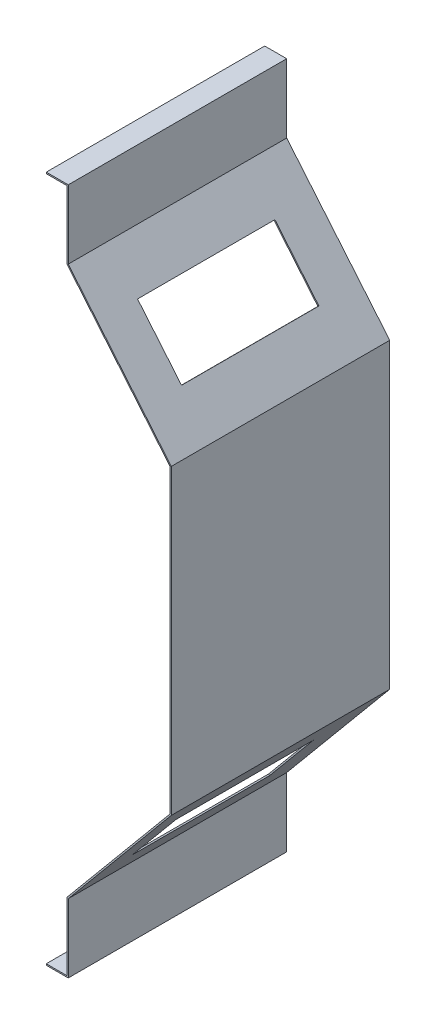
ISO-10303-21;
HEADER;
FILE_DESCRIPTION(('STEP AP214'),'2;1');
FILE_NAME('part.step','',(''),(''),'','','');
FILE_SCHEMA(('AUTOMOTIVE_DESIGN { 1 0 10303 214 1 1 1 1 }'));
ENDSEC;
DATA;
#1=APPLICATION_CONTEXT('core data for automotive mechanical design processes');
#2=APPLICATION_PROTOCOL_DEFINITION('international standard','automotive_design',2000,#1);
#3=PRODUCT_CONTEXT('',#1,'mechanical');
#4=PRODUCT('Part','Part','',(#3));
#5=PRODUCT_RELATED_PRODUCT_CATEGORY('part','',(#4));
#6=PRODUCT_DEFINITION_FORMATION('','',#4);
#7=PRODUCT_DEFINITION_CONTEXT('part definition',#1,'design');
#8=PRODUCT_DEFINITION('design','',#6,#7);
#9=PRODUCT_DEFINITION_SHAPE('','',#8);
#10=(LENGTH_UNIT() NAMED_UNIT(*) SI_UNIT(.MILLI.,.METRE.));
#11=(NAMED_UNIT(*) PLANE_ANGLE_UNIT() SI_UNIT($,.RADIAN.));
#12=(NAMED_UNIT(*) SI_UNIT($,.STERADIAN.) SOLID_ANGLE_UNIT());
#13=UNCERTAINTY_MEASURE_WITH_UNIT(LENGTH_MEASURE(1.E-05),#10,'distance_accuracy_value','');
#14=(GEOMETRIC_REPRESENTATION_CONTEXT(3) GLOBAL_UNCERTAINTY_ASSIGNED_CONTEXT((#13)) GLOBAL_UNIT_ASSIGNED_CONTEXT((#10,
#11,#12)) REPRESENTATION_CONTEXT('',''));
#15=CARTESIAN_POINT('',(0.,0.,0.));
#16=DIRECTION('',(0.,0.,1.));
#17=DIRECTION('',(1.,0.,0.));
#18=AXIS2_PLACEMENT_3D('',#15,#16,#17);
#19=CARTESIAN_POINT('',(-91.,250.,159.));
#20=DIRECTION('',(0.,-1.,0.));
#21=DIRECTION('',(0.,0.,-1.));
#22=AXIS2_PLACEMENT_3D('',#19,#20,#21);
#23=PLANE('',#22);
#24=DIRECTION('',(-1.,0.,0.));
#25=VECTOR('',#24,1.);
#26=CARTESIAN_POINT('',(-91.,250.,0.));
#27=LINE('',#26,#25);
#28=CARTESIAN_POINT('',(-75.,250.,0.));
#29=VERTEX_POINT('',#28);
#30=CARTESIAN_POINT('',(-91.,250.,0.));
#31=VERTEX_POINT('',#30);
#32=EDGE_CURVE('E263',#29,#31,#27,.T.);
#33=ORIENTED_EDGE('',*,*,#32,.T.);
#34=DIRECTION('',(0.,0.,-1.));
#35=VECTOR('',#34,1.);
#36=CARTESIAN_POINT('',(-91.,250.,159.));
#37=LINE('',#36,#35);
#38=CARTESIAN_POINT('',(-91.,250.,159.));
#39=VERTEX_POINT('',#38);
#40=EDGE_CURVE('E41',#39,#31,#37,.T.);
#41=ORIENTED_EDGE('',*,*,#40,.F.);
#42=DIRECTION('',(-1.,0.,0.));
#43=VECTOR('',#42,1.);
#44=CARTESIAN_POINT('',(-91.,250.,159.));
#45=LINE('',#44,#43);
#46=CARTESIAN_POINT('',(-75.,250.,159.));
#47=VERTEX_POINT('',#46);
#48=EDGE_CURVE('E267',#47,#39,#45,.T.);
#49=ORIENTED_EDGE('',*,*,#48,.F.);
#50=DIRECTION('',(0.,0.,-1.));
#51=VECTOR('',#50,1.);
#52=CARTESIAN_POINT('',(-75.,250.,159.));
#53=LINE('',#52,#51);
#54=EDGE_CURVE('E11',#47,#29,#53,.T.);
#55=ORIENTED_EDGE('',*,*,#54,.T.);
#56=EDGE_LOOP('',(#33,#41,#49,#55));
#57=FACE_BOUND('',#56,.T.);
#58=ADVANCED_FACE('F34',(#57),#23,.F.);
#59=CARTESIAN_POINT('',(-91.,250.,159.));
#60=DIRECTION('',(1.,0.,0.));
#61=DIRECTION('',(0.,0.,-1.));
#62=AXIS2_PLACEMENT_3D('',#59,#60,#61);
#63=PLANE('',#62);
#64=DIRECTION('',(0.,-1.,0.));
#65=VECTOR('',#64,1.);
#66=CARTESIAN_POINT('',(-91.,250.,0.));
#67=LINE('',#66,#65);
#68=CARTESIAN_POINT('',(-91.,249.,0.));
#69=VERTEX_POINT('',#68);
#70=EDGE_CURVE('E301',#31,#69,#67,.T.);
#71=ORIENTED_EDGE('',*,*,#70,.T.);
#72=DIRECTION('',(0.,0.,-1.));
#73=VECTOR('',#72,1.);
#74=CARTESIAN_POINT('',(-91.,249.,159.));
#75=LINE('',#74,#73);
#76=CARTESIAN_POINT('',(-91.,249.,159.));
#77=VERTEX_POINT('',#76);
#78=EDGE_CURVE('E369',#77,#69,#75,.T.);
#79=ORIENTED_EDGE('',*,*,#78,.F.);
#80=DIRECTION('',(0.,-1.,0.));
#81=VECTOR('',#80,1.);
#82=CARTESIAN_POINT('',(-91.,250.,159.));
#83=LINE('',#82,#81);
#84=EDGE_CURVE('E270',#39,#77,#83,.T.);
#85=ORIENTED_EDGE('',*,*,#84,.F.);
#86=ORIENTED_EDGE('',*,*,#40,.T.);
#87=EDGE_LOOP('',(#71,#79,#85,#86));
#88=FACE_BOUND('',#87,.T.);
#89=ADVANCED_FACE('F376',(#88),#63,.F.);
#90=CARTESIAN_POINT('',(-76.,249.,159.));
#91=DIRECTION('',(0.,1.,0.));
#92=DIRECTION('',(0.,0.,1.));
#93=AXIS2_PLACEMENT_3D('',#90,#91,#92);
#94=PLANE('',#93);
#95=DIRECTION('',(1.,0.,0.));
#96=VECTOR('',#95,1.);
#97=CARTESIAN_POINT('',(-76.,249.,0.));
#98=LINE('',#97,#96);
#99=CARTESIAN_POINT('',(-76.,249.,0.));
#100=VERTEX_POINT('',#99);
#101=EDGE_CURVE('E303',#69,#100,#98,.T.);
#102=ORIENTED_EDGE('',*,*,#101,.T.);
#103=DIRECTION('',(0.,0.,-1.));
#104=VECTOR('',#103,1.);
#105=CARTESIAN_POINT('',(-76.,249.,159.));
#106=LINE('',#105,#104);
#107=CARTESIAN_POINT('',(-76.,249.,159.));
#108=VERTEX_POINT('',#107);
#109=EDGE_CURVE('E366',#108,#100,#106,.T.);
#110=ORIENTED_EDGE('',*,*,#109,.F.);
#111=DIRECTION('',(1.,0.,0.));
#112=VECTOR('',#111,1.);
#113=CARTESIAN_POINT('',(-76.,249.,159.));
#114=LINE('',#113,#112);
#115=EDGE_CURVE('E272',#77,#108,#114,.T.);
#116=ORIENTED_EDGE('',*,*,#115,.F.);
#117=ORIENTED_EDGE('',*,*,#78,.T.);
#118=EDGE_LOOP('',(#102,#110,#116,#117));
#119=FACE_BOUND('',#118,.T.);
#120=ADVANCED_FACE('F388',(#119),#94,.F.);
#121=CARTESIAN_POINT('',(-76.,249.,159.));
#122=DIRECTION('',(1.,0.,0.));
#123=DIRECTION('',(0.,1.,0.));
#124=AXIS2_PLACEMENT_3D('',#121,#122,#123);
#125=PLANE('',#124);
#126=DIRECTION('',(0.,-1.,0.));
#127=VECTOR('',#126,1.);
#128=CARTESIAN_POINT('',(-76.,249.,0.));
#129=LINE('',#128,#127);
#130=CARTESIAN_POINT('',(-76.,199.637950064819,0.));
#131=VERTEX_POINT('',#130);
#132=EDGE_CURVE('E305',#100,#131,#129,.T.);
#133=ORIENTED_EDGE('',*,*,#132,.T.);
#134=DIRECTION('',(0.,0.,-1.));
#135=VECTOR('',#134,1.);
#136=CARTESIAN_POINT('',(-76.,199.637950064819,159.));
#137=LINE('',#136,#135);
#138=CARTESIAN_POINT('',(-76.,199.637950064819,159.));
#139=VERTEX_POINT('',#138);
#140=EDGE_CURVE('E363',#139,#131,#137,.T.);
#141=ORIENTED_EDGE('',*,*,#140,.F.);
#142=DIRECTION('',(0.,-1.,0.));
#143=VECTOR('',#142,1.);
#144=CARTESIAN_POINT('',(-76.,249.,159.));
#145=LINE('',#144,#143);
#146=EDGE_CURVE('E274',#108,#139,#145,.T.);
#147=ORIENTED_EDGE('',*,*,#146,.F.);
#148=ORIENTED_EDGE('',*,*,#109,.T.);
#149=EDGE_LOOP('',(#133,#141,#147,#148));
#150=FACE_BOUND('',#149,.T.);
#151=ADVANCED_FACE('F392',(#150),#125,.F.);
#152=CARTESIAN_POINT('',(-76.,199.637950064819,159.));
#153=DIRECTION('',(0.768221279597376,0.64018439966448,0.));
#154=DIRECTION('',(-0.64018439966448,0.768221279597376,0.));
#155=AXIS2_PLACEMENT_3D('',#152,#153,#154);
#156=PLANE('',#155);
#157=DIRECTION('',(0.,0.,-1.));
#158=VECTOR('',#157,1.);
#159=CARTESIAN_POINT('',(-22.3128239076133,135.213338753955,159.));
#160=LINE('',#159,#158);
#161=CARTESIAN_POINT('',(-22.3128239076133,135.213338753955,130.));
#162=VERTEX_POINT('',#161);
#163=CARTESIAN_POINT('',(-22.3128239076133,135.213338753955,30.));
#164=VERTEX_POINT('',#163);
#165=EDGE_CURVE('E225',#162,#164,#160,.T.);
#166=ORIENTED_EDGE('',*,*,#165,.T.);
#167=DIRECTION('',(-0.64018439966448,0.768221279597376,0.));
#168=VECTOR('',#167,1.);
#169=CARTESIAN_POINT('',(-76.,199.637950064819,30.));
#170=LINE('',#169,#168);
#171=CARTESIAN_POINT('',(-54.3220438908373,173.624402733823,30.));
#172=VERTEX_POINT('',#171);
#173=EDGE_CURVE('E228',#164,#172,#170,.T.);
#174=ORIENTED_EDGE('',*,*,#173,.T.);
#175=DIRECTION('',(0.,0.,1.));
#176=VECTOR('',#175,1.);
#177=CARTESIAN_POINT('',(-54.3220438908373,173.624402733823,159.));
#178=LINE('',#177,#176);
#179=CARTESIAN_POINT('',(-54.3220438908373,173.624402733823,130.));
#180=VERTEX_POINT('',#179);
#181=EDGE_CURVE('E220',#172,#180,#178,.T.);
#182=ORIENTED_EDGE('',*,*,#181,.T.);
#183=DIRECTION('',(0.64018439966448,-0.768221279597376,0.));
#184=VECTOR('',#183,1.);
#185=CARTESIAN_POINT('',(-76.,199.637950064819,130.));
#186=LINE('',#185,#184);
#187=EDGE_CURVE('E200',#180,#162,#186,.T.);
#188=ORIENTED_EDGE('',*,*,#187,.T.);
#189=EDGE_LOOP('',(#166,#174,#182,#188));
#190=FACE_BOUND('',#189,.T.);
#191=DIRECTION('',(0.64018439966448,-0.768221279597376,0.));
#192=VECTOR('',#191,1.);
#193=CARTESIAN_POINT('',(-76.,199.637950064819,0.));
#194=LINE('',#193,#192);
#195=CARTESIAN_POINT('',(-1.,109.637950064819,0.));
#196=VERTEX_POINT('',#195);
#197=EDGE_CURVE('E307',#131,#196,#194,.T.);
#198=ORIENTED_EDGE('',*,*,#197,.T.);
#199=DIRECTION('',(0.,0.,-1.));
#200=VECTOR('',#199,1.);
#201=CARTESIAN_POINT('',(-1.,109.637950064819,159.));
#202=LINE('',#201,#200);
#203=CARTESIAN_POINT('',(-1.,109.637950064819,159.));
#204=VERTEX_POINT('',#203);
#205=EDGE_CURVE('E360',#204,#196,#202,.T.);
#206=ORIENTED_EDGE('',*,*,#205,.F.);
#207=DIRECTION('',(0.64018439966448,-0.768221279597376,0.));
#208=VECTOR('',#207,1.);
#209=CARTESIAN_POINT('',(-76.,199.637950064819,159.));
#210=LINE('',#209,#208);
#211=EDGE_CURVE('E276',#139,#204,#210,.T.);
#212=ORIENTED_EDGE('',*,*,#211,.F.);
#213=ORIENTED_EDGE('',*,*,#140,.T.);
#214=EDGE_LOOP('',(#198,#206,#212,#213));
#215=FACE_BOUND('',#214,.T.);
#216=ADVANCED_FACE('F449',(#190,#215),#156,.F.);
#217=CARTESIAN_POINT('',(-1.,109.637950064819,159.));
#218=DIRECTION('',(1.,0.,0.));
#219=DIRECTION('',(0.,1.,0.));
#220=AXIS2_PLACEMENT_3D('',#217,#218,#219);
#221=PLANE('',#220);
#222=DIRECTION('',(0.,-1.,0.));
#223=VECTOR('',#222,1.);
#224=CARTESIAN_POINT('',(-1.,109.637950064819,0.));
#225=LINE('',#224,#223);
#226=CARTESIAN_POINT('',(-1.,-109.637950064819,0.));
#227=VERTEX_POINT('',#226);
#228=EDGE_CURVE('E309',#196,#227,#225,.T.);
#229=ORIENTED_EDGE('',*,*,#228,.T.);
#230=DIRECTION('',(0.,0.,-1.));
#231=VECTOR('',#230,1.);
#232=CARTESIAN_POINT('',(-1.,-109.637950064819,159.));
#233=LINE('',#232,#231);
#234=CARTESIAN_POINT('',(-1.,-109.637950064819,159.));
#235=VERTEX_POINT('',#234);
#236=EDGE_CURVE('E357',#235,#227,#233,.T.);
#237=ORIENTED_EDGE('',*,*,#236,.F.);
#238=DIRECTION('',(0.,-1.,0.));
#239=VECTOR('',#238,1.);
#240=CARTESIAN_POINT('',(-1.,109.637950064819,159.));
#241=LINE('',#240,#239);
#242=EDGE_CURVE('E278',#204,#235,#241,.T.);
#243=ORIENTED_EDGE('',*,*,#242,.F.);
#244=ORIENTED_EDGE('',*,*,#205,.T.);
#245=EDGE_LOOP('',(#229,#237,#243,#244));
#246=FACE_BOUND('',#245,.T.);
#247=ADVANCED_FACE('F446',(#246),#221,.F.);
#248=CARTESIAN_POINT('',(-76.,-199.637950064819,159.));
#249=DIRECTION('',(0.768221279597376,-0.64018439966448,0.));
#250=DIRECTION('',(0.64018439966448,0.768221279597376,0.));
#251=AXIS2_PLACEMENT_3D('',#248,#249,#250);
#252=PLANE('',#251);
#253=DIRECTION('',(0.,0.,-1.));
#254=VECTOR('',#253,1.);
#255=CARTESIAN_POINT('',(-54.2236186515814,-173.506292446716,159.));
#256=LINE('',#255,#254);
#257=CARTESIAN_POINT('',(-54.2236186515814,-173.506292446716,134.));
#258=VERTEX_POINT('',#257);
#259=CARTESIAN_POINT('',(-54.2236186515815,-173.506292446716,34.));
#260=VERTEX_POINT('',#259);
#261=EDGE_CURVE('E257',#258,#260,#256,.T.);
#262=ORIENTED_EDGE('',*,*,#261,.T.);
#263=DIRECTION('',(0.64018439966448,0.768221279597376,0.));
#264=VECTOR('',#263,1.);
#265=CARTESIAN_POINT('',(-76.,-199.637950064819,34.));
#266=LINE('',#265,#264);
#267=CARTESIAN_POINT('',(-22.2143986683575,-135.095228466848,34.));
#268=VERTEX_POINT('',#267);
#269=EDGE_CURVE('E260',#260,#268,#266,.T.);
#270=ORIENTED_EDGE('',*,*,#269,.T.);
#271=DIRECTION('',(0.,0.,1.));
#272=VECTOR('',#271,1.);
#273=CARTESIAN_POINT('',(-22.2143986683574,-135.095228466848,159.));
#274=LINE('',#273,#272);
#275=CARTESIAN_POINT('',(-22.2143986683574,-135.095228466848,134.));
#276=VERTEX_POINT('',#275);
#277=EDGE_CURVE('E245',#268,#276,#274,.T.);
#278=ORIENTED_EDGE('',*,*,#277,.T.);
#279=DIRECTION('',(-0.64018439966448,-0.768221279597376,0.));
#280=VECTOR('',#279,1.);
#281=CARTESIAN_POINT('',(-76.,-199.637950064819,134.));
#282=LINE('',#281,#280);
#283=EDGE_CURVE('E254',#276,#258,#282,.T.);
#284=ORIENTED_EDGE('',*,*,#283,.T.);
#285=EDGE_LOOP('',(#262,#270,#278,#284));
#286=FACE_BOUND('',#285,.T.);
#287=DIRECTION('',(-0.64018439966448,-0.768221279597376,0.));
#288=VECTOR('',#287,1.);
#289=CARTESIAN_POINT('',(-76.,-199.637950064819,0.));
#290=LINE('',#289,#288);
#291=CARTESIAN_POINT('',(-76.,-199.637950064819,0.));
#292=VERTEX_POINT('',#291);
#293=EDGE_CURVE('E311',#227,#292,#290,.T.);
#294=ORIENTED_EDGE('',*,*,#293,.T.);
#295=DIRECTION('',(0.,0.,-1.));
#296=VECTOR('',#295,1.);
#297=CARTESIAN_POINT('',(-76.,-199.637950064819,159.));
#298=LINE('',#297,#296);
#299=CARTESIAN_POINT('',(-76.,-199.637950064819,159.));
#300=VERTEX_POINT('',#299);
#301=EDGE_CURVE('E354',#300,#292,#298,.T.);
#302=ORIENTED_EDGE('',*,*,#301,.F.);
#303=DIRECTION('',(-0.64018439966448,-0.768221279597376,0.));
#304=VECTOR('',#303,1.);
#305=CARTESIAN_POINT('',(-76.,-199.637950064819,159.));
#306=LINE('',#305,#304);
#307=EDGE_CURVE('E280',#235,#300,#306,.T.);
#308=ORIENTED_EDGE('',*,*,#307,.F.);
#309=ORIENTED_EDGE('',*,*,#236,.T.);
#310=EDGE_LOOP('',(#294,#302,#308,#309));
#311=FACE_BOUND('',#310,.T.);
#312=ADVANCED_FACE('F442',(#286,#311),#252,.F.);
#313=CARTESIAN_POINT('',(-76.,-249.,159.));
#314=DIRECTION('',(1.,0.,0.));
#315=DIRECTION('',(0.,1.,0.));
#316=AXIS2_PLACEMENT_3D('',#313,#314,#315);
#317=PLANE('',#316);
#318=DIRECTION('',(0.,-1.,0.));
#319=VECTOR('',#318,1.);
#320=CARTESIAN_POINT('',(-76.,-249.,0.));
#321=LINE('',#320,#319);
#322=CARTESIAN_POINT('',(-76.,-249.,0.));
#323=VERTEX_POINT('',#322);
#324=EDGE_CURVE('E313',#292,#323,#321,.T.);
#325=ORIENTED_EDGE('',*,*,#324,.T.);
#326=DIRECTION('',(0.,0.,-1.));
#327=VECTOR('',#326,1.);
#328=CARTESIAN_POINT('',(-76.,-249.,159.));
#329=LINE('',#328,#327);
#330=CARTESIAN_POINT('',(-76.,-249.,159.));
#331=VERTEX_POINT('',#330);
#332=EDGE_CURVE('E351',#331,#323,#329,.T.);
#333=ORIENTED_EDGE('',*,*,#332,.F.);
#334=DIRECTION('',(0.,-1.,0.));
#335=VECTOR('',#334,1.);
#336=CARTESIAN_POINT('',(-76.,-249.,159.));
#337=LINE('',#336,#335);
#338=EDGE_CURVE('E282',#300,#331,#337,.T.);
#339=ORIENTED_EDGE('',*,*,#338,.F.);
#340=ORIENTED_EDGE('',*,*,#301,.T.);
#341=EDGE_LOOP('',(#325,#333,#339,#340));
#342=FACE_BOUND('',#341,.T.);
#343=ADVANCED_FACE('F438',(#342),#317,.F.);
#344=CARTESIAN_POINT('',(-76.,-249.,159.));
#345=DIRECTION('',(0.,-1.,0.));
#346=DIRECTION('',(0.,0.,-1.));
#347=AXIS2_PLACEMENT_3D('',#344,#345,#346);
#348=PLANE('',#347);
#349=DIRECTION('',(-1.,0.,0.));
#350=VECTOR('',#349,1.);
#351=CARTESIAN_POINT('',(-76.,-249.,0.));
#352=LINE('',#351,#350);
#353=CARTESIAN_POINT('',(-91.,-249.,0.));
#354=VERTEX_POINT('',#353);
#355=EDGE_CURVE('E315',#323,#354,#352,.T.);
#356=ORIENTED_EDGE('',*,*,#355,.T.);
#357=DIRECTION('',(0.,0.,-1.));
#358=VECTOR('',#357,1.);
#359=CARTESIAN_POINT('',(-91.,-249.,159.));
#360=LINE('',#359,#358);
#361=CARTESIAN_POINT('',(-91.,-249.,159.));
#362=VERTEX_POINT('',#361);
#363=EDGE_CURVE('E348',#362,#354,#360,.T.);
#364=ORIENTED_EDGE('',*,*,#363,.F.);
#365=DIRECTION('',(-1.,0.,0.));
#366=VECTOR('',#365,1.);
#367=CARTESIAN_POINT('',(-76.,-249.,159.));
#368=LINE('',#367,#366);
#369=EDGE_CURVE('E284',#331,#362,#368,.T.);
#370=ORIENTED_EDGE('',*,*,#369,.F.);
#371=ORIENTED_EDGE('',*,*,#332,.T.);
#372=EDGE_LOOP('',(#356,#364,#370,#371));
#373=FACE_BOUND('',#372,.T.);
#374=ADVANCED_FACE('F434',(#373),#348,.F.);
#375=CARTESIAN_POINT('',(-91.,-250.,159.));
#376=DIRECTION('',(1.,0.,0.));
#377=DIRECTION('',(0.,0.,-1.));
#378=AXIS2_PLACEMENT_3D('',#375,#376,#377);
#379=PLANE('',#378);
#380=DIRECTION('',(0.,-1.,0.));
#381=VECTOR('',#380,1.);
#382=CARTESIAN_POINT('',(-91.,-250.,0.));
#383=LINE('',#382,#381);
#384=CARTESIAN_POINT('',(-91.,-250.,0.));
#385=VERTEX_POINT('',#384);
#386=EDGE_CURVE('E317',#354,#385,#383,.T.);
#387=ORIENTED_EDGE('',*,*,#386,.T.);
#388=DIRECTION('',(0.,0.,-1.));
#389=VECTOR('',#388,1.);
#390=CARTESIAN_POINT('',(-91.,-250.,159.));
#391=LINE('',#390,#389);
#392=CARTESIAN_POINT('',(-91.,-250.,159.));
#393=VERTEX_POINT('',#392);
#394=EDGE_CURVE('E345',#393,#385,#391,.T.);
#395=ORIENTED_EDGE('',*,*,#394,.F.);
#396=DIRECTION('',(0.,-1.,0.));
#397=VECTOR('',#396,1.);
#398=CARTESIAN_POINT('',(-91.,-250.,159.));
#399=LINE('',#398,#397);
#400=EDGE_CURVE('E286',#362,#393,#399,.T.);
#401=ORIENTED_EDGE('',*,*,#400,.F.);
#402=ORIENTED_EDGE('',*,*,#363,.T.);
#403=EDGE_LOOP('',(#387,#395,#401,#402));
#404=FACE_BOUND('',#403,.T.);
#405=ADVANCED_FACE('F429',(#404),#379,.F.);
#406=CARTESIAN_POINT('',(-91.,-250.,159.));
#407=DIRECTION('',(0.,1.,0.));
#408=DIRECTION('',(0.,0.,1.));
#409=AXIS2_PLACEMENT_3D('',#406,#407,#408);
#410=PLANE('',#409);
#411=DIRECTION('',(1.,0.,0.));
#412=VECTOR('',#411,1.);
#413=CARTESIAN_POINT('',(-91.,-250.,0.));
#414=LINE('',#413,#412);
#415=CARTESIAN_POINT('',(-75.,-250.,0.));
#416=VERTEX_POINT('',#415);
#417=EDGE_CURVE('E319',#385,#416,#414,.T.);
#418=ORIENTED_EDGE('',*,*,#417,.T.);
#419=DIRECTION('',(0.,0.,-1.));
#420=VECTOR('',#419,1.);
#421=CARTESIAN_POINT('',(-75.,-250.,159.));
#422=LINE('',#421,#420);
#423=CARTESIAN_POINT('',(-75.,-250.,159.));
#424=VERTEX_POINT('',#423);
#425=EDGE_CURVE('E342',#424,#416,#422,.T.);
#426=ORIENTED_EDGE('',*,*,#425,.F.);
#427=DIRECTION('',(1.,0.,0.));
#428=VECTOR('',#427,1.);
#429=CARTESIAN_POINT('',(-91.,-250.,159.));
#430=LINE('',#429,#428);
#431=EDGE_CURVE('E288',#393,#424,#430,.T.);
#432=ORIENTED_EDGE('',*,*,#431,.F.);
#433=ORIENTED_EDGE('',*,*,#394,.T.);
#434=EDGE_LOOP('',(#418,#426,#432,#433));
#435=FACE_BOUND('',#434,.T.);
#436=ADVANCED_FACE('F420',(#435),#410,.F.);
#437=CARTESIAN_POINT('',(-75.,-249.,159.));
#438=DIRECTION('',(-1.,0.,0.));
#439=DIRECTION('',(0.,-1.,0.));
#440=AXIS2_PLACEMENT_3D('',#437,#438,#439);
#441=PLANE('',#440);
#442=DIRECTION('',(0.,1.,0.));
#443=VECTOR('',#442,1.);
#444=CARTESIAN_POINT('',(-75.,-249.,0.));
#445=LINE('',#444,#443);
#446=CARTESIAN_POINT('',(-75.,-200.,0.));
#447=VERTEX_POINT('',#446);
#448=EDGE_CURVE('E322',#416,#447,#445,.T.);
#449=ORIENTED_EDGE('',*,*,#448,.T.);
#450=DIRECTION('',(0.,0.,-1.));
#451=VECTOR('',#450,1.);
#452=CARTESIAN_POINT('',(-75.,-200.,159.));
#453=LINE('',#452,#451);
#454=CARTESIAN_POINT('',(-75.,-200.,159.));
#455=VERTEX_POINT('',#454);
#456=EDGE_CURVE('E339',#455,#447,#453,.T.);
#457=ORIENTED_EDGE('',*,*,#456,.F.);
#458=DIRECTION('',(0.,1.,0.));
#459=VECTOR('',#458,1.);
#460=CARTESIAN_POINT('',(-75.,-250.,159.));
#461=LINE('',#460,#459);
#462=EDGE_CURVE('E290',#424,#455,#461,.T.);
#463=ORIENTED_EDGE('',*,*,#462,.F.);
#464=ORIENTED_EDGE('',*,*,#425,.T.);
#465=EDGE_LOOP('',(#449,#457,#463,#464));
#466=FACE_BOUND('',#465,.T.);
#467=ADVANCED_FACE('F424',(#466),#441,.F.);
#468=CARTESIAN_POINT('',(-75.,-200.,159.));
#469=DIRECTION('',(-0.768221279597376,0.64018439966448,0.));
#470=DIRECTION('',(-0.64018439966448,-0.768221279597376,0.));
#471=AXIS2_PLACEMENT_3D('',#468,#469,#470);
#472=PLANE('',#471);
#473=DIRECTION('',(0.,0.,1.));
#474=VECTOR('',#473,1.);
#475=CARTESIAN_POINT('',(-21.4461773887603,-135.735412866512,134.));
#476=LINE('',#475,#474);
#477=CARTESIAN_POINT('',(-21.4461773887601,-135.735412866512,34.));
#478=VERTEX_POINT('',#477);
#479=CARTESIAN_POINT('',(-21.4461773887603,-135.735412866512,134.));
#480=VERTEX_POINT('',#479);
#481=EDGE_CURVE('E233',#478,#480,#476,.T.);
#482=ORIENTED_EDGE('',*,*,#481,.F.);
#483=DIRECTION('',(0.640184399664481,0.768221279597375,0.));
#484=VECTOR('',#483,1.);
#485=CARTESIAN_POINT('',(-21.4461773887603,-135.735412866512,34.));
#486=LINE('',#485,#484);
#487=CARTESIAN_POINT('',(-53.4553973719843,-174.146476846381,34.));
#488=VERTEX_POINT('',#487);
#489=EDGE_CURVE('E231',#488,#478,#486,.T.);
#490=ORIENTED_EDGE('',*,*,#489,.F.);
#491=DIRECTION('',(0.,0.,-1.));
#492=VECTOR('',#491,1.);
#493=CARTESIAN_POINT('',(-53.4553973719843,-174.146476846381,134.));
#494=LINE('',#493,#492);
#495=CARTESIAN_POINT('',(-53.4553973719843,-174.146476846381,134.));
#496=VERTEX_POINT('',#495);
#497=EDGE_CURVE('E239',#496,#488,#494,.T.);
#498=ORIENTED_EDGE('',*,*,#497,.F.);
#499=DIRECTION('',(-0.640184399664481,-0.768221279597375,0.));
#500=VECTOR('',#499,1.);
#501=CARTESIAN_POINT('',(-21.4461773887603,-135.735412866512,134.));
#502=LINE('',#501,#500);
#503=EDGE_CURVE('E236',#480,#496,#502,.T.);
#504=ORIENTED_EDGE('',*,*,#503,.F.);
#505=EDGE_LOOP('',(#482,#490,#498,#504));
#506=FACE_BOUND('',#505,.T.);
#507=DIRECTION('',(0.64018439966448,0.768221279597376,0.));
#508=VECTOR('',#507,1.);
#509=CARTESIAN_POINT('',(-75.,-200.,0.));
#510=LINE('',#509,#508);
#511=CARTESIAN_POINT('',(0.,-110.,0.));
#512=VERTEX_POINT('',#511);
#513=EDGE_CURVE('E324',#447,#512,#510,.T.);
#514=ORIENTED_EDGE('',*,*,#513,.T.);
#515=DIRECTION('',(0.,0.,-1.));
#516=VECTOR('',#515,1.);
#517=CARTESIAN_POINT('',(0.,-110.,159.));
#518=LINE('',#517,#516);
#519=CARTESIAN_POINT('',(0.,-110.,159.));
#520=VERTEX_POINT('',#519);
#521=EDGE_CURVE('E336',#520,#512,#518,.T.);
#522=ORIENTED_EDGE('',*,*,#521,.F.);
#523=DIRECTION('',(0.64018439966448,0.768221279597376,0.));
#524=VECTOR('',#523,1.);
#525=CARTESIAN_POINT('',(-75.,-200.,159.));
#526=LINE('',#525,#524);
#527=EDGE_CURVE('E292',#455,#520,#526,.T.);
#528=ORIENTED_EDGE('',*,*,#527,.F.);
#529=ORIENTED_EDGE('',*,*,#456,.T.);
#530=EDGE_LOOP('',(#514,#522,#528,#529));
#531=FACE_BOUND('',#530,.T.);
#532=ADVANCED_FACE('F413',(#506,#531),#472,.F.);
#533=CARTESIAN_POINT('',(0.,110.,159.));
#534=DIRECTION('',(-1.,0.,0.));
#535=DIRECTION('',(0.,-1.,0.));
#536=AXIS2_PLACEMENT_3D('',#533,#534,#535);
#537=PLANE('',#536);
#538=DIRECTION('',(0.,1.,0.));
#539=VECTOR('',#538,1.);
#540=CARTESIAN_POINT('',(0.,110.,0.));
#541=LINE('',#540,#539);
#542=CARTESIAN_POINT('',(0.,110.,0.));
#543=VERTEX_POINT('',#542);
#544=EDGE_CURVE('E326',#512,#543,#541,.T.);
#545=ORIENTED_EDGE('',*,*,#544,.T.);
#546=DIRECTION('',(0.,0.,-1.));
#547=VECTOR('',#546,1.);
#548=CARTESIAN_POINT('',(0.,110.,159.));
#549=LINE('',#548,#547);
#550=CARTESIAN_POINT('',(0.,110.,159.));
#551=VERTEX_POINT('',#550);
#552=EDGE_CURVE('E333',#551,#543,#549,.T.);
#553=ORIENTED_EDGE('',*,*,#552,.F.);
#554=DIRECTION('',(0.,1.,0.));
#555=VECTOR('',#554,1.);
#556=CARTESIAN_POINT('',(0.,110.,159.));
#557=LINE('',#556,#555);
#558=EDGE_CURVE('E294',#520,#551,#557,.T.);
#559=ORIENTED_EDGE('',*,*,#558,.F.);
#560=ORIENTED_EDGE('',*,*,#521,.T.);
#561=EDGE_LOOP('',(#545,#553,#559,#560));
#562=FACE_BOUND('',#561,.T.);
#563=ADVANCED_FACE('F409',(#562),#537,.F.);
#564=CARTESIAN_POINT('',(-75.,200.,159.));
#565=DIRECTION('',(-0.768221279597376,-0.64018439966448,0.));
#566=DIRECTION('',(0.64018439966448,-0.768221279597376,0.));
#567=AXIS2_PLACEMENT_3D('',#564,#565,#566);
#568=PLANE('',#567);
#569=DIRECTION('',(0.,0.,1.));
#570=VECTOR('',#569,1.);
#571=CARTESIAN_POINT('',(-53.5538226112396,174.264587133488,130.));
#572=LINE('',#571,#570);
#573=CARTESIAN_POINT('',(-53.55382261124,174.264587133488,30.));
#574=VERTEX_POINT('',#573);
#575=CARTESIAN_POINT('',(-53.5538226112396,174.264587133488,130.));
#576=VERTEX_POINT('',#575);
#577=EDGE_CURVE('E206',#574,#576,#572,.T.);
#578=ORIENTED_EDGE('',*,*,#577,.F.);
#579=DIRECTION('',(-0.640184399664478,0.768221279597378,0.));
#580=VECTOR('',#579,1.);
#581=CARTESIAN_POINT('',(-53.5538226112396,174.264587133488,30.));
#582=LINE('',#581,#580);
#583=CARTESIAN_POINT('',(-21.5446026280157,135.853523153619,30.));
#584=VERTEX_POINT('',#583);
#585=EDGE_CURVE('E56',#584,#574,#582,.T.);
#586=ORIENTED_EDGE('',*,*,#585,.F.);
#587=DIRECTION('',(0.,0.,-1.));
#588=VECTOR('',#587,1.);
#589=CARTESIAN_POINT('',(-21.5446026280157,135.853523153619,130.));
#590=LINE('',#589,#588);
#591=CARTESIAN_POINT('',(-21.5446026280157,135.853523153619,130.));
#592=VERTEX_POINT('',#591);
#593=EDGE_CURVE('E213',#592,#584,#590,.T.);
#594=ORIENTED_EDGE('',*,*,#593,.F.);
#595=DIRECTION('',(0.640184399664478,-0.768221279597378,0.));
#596=VECTOR('',#595,1.);
#597=CARTESIAN_POINT('',(-53.5538226112396,174.264587133488,130.));
#598=LINE('',#597,#596);
#599=EDGE_CURVE('E197',#576,#592,#598,.T.);
#600=ORIENTED_EDGE('',*,*,#599,.F.);
#601=EDGE_LOOP('',(#578,#586,#594,#600));
#602=FACE_BOUND('',#601,.T.);
#603=DIRECTION('',(-0.64018439966448,0.768221279597376,0.));
#604=VECTOR('',#603,1.);
#605=CARTESIAN_POINT('',(-75.,200.,0.));
#606=LINE('',#605,#604);
#607=CARTESIAN_POINT('',(-75.,200.,0.));
#608=VERTEX_POINT('',#607);
#609=EDGE_CURVE('E328',#543,#608,#606,.T.);
#610=ORIENTED_EDGE('',*,*,#609,.T.);
#611=DIRECTION('',(0.,0.,-1.));
#612=VECTOR('',#611,1.);
#613=CARTESIAN_POINT('',(-75.,200.,159.));
#614=LINE('',#613,#612);
#615=CARTESIAN_POINT('',(-75.,200.,159.));
#616=VERTEX_POINT('',#615);
#617=EDGE_CURVE('E299',#616,#608,#614,.T.);
#618=ORIENTED_EDGE('',*,*,#617,.F.);
#619=DIRECTION('',(-0.64018439966448,0.768221279597376,0.));
#620=VECTOR('',#619,1.);
#621=CARTESIAN_POINT('',(-75.,200.,159.));
#622=LINE('',#621,#620);
#623=EDGE_CURVE('E296',#551,#616,#622,.T.);
#624=ORIENTED_EDGE('',*,*,#623,.F.);
#625=ORIENTED_EDGE('',*,*,#552,.T.);
#626=EDGE_LOOP('',(#610,#618,#624,#625));
#627=FACE_BOUND('',#626,.T.);
#628=ADVANCED_FACE('F210',(#602,#627),#568,.F.);
#629=CARTESIAN_POINT('',(-75.,249.,159.));
#630=DIRECTION('',(-1.,0.,0.));
#631=DIRECTION('',(0.,-1.,0.));
#632=AXIS2_PLACEMENT_3D('',#629,#630,#631);
#633=PLANE('',#632);
#634=DIRECTION('',(0.,1.,0.));
#635=VECTOR('',#634,1.);
#636=CARTESIAN_POINT('',(-75.,249.,0.));
#637=LINE('',#636,#635);
#638=EDGE_CURVE('E268',#608,#29,#637,.T.);
#639=ORIENTED_EDGE('',*,*,#638,.T.);
#640=ORIENTED_EDGE('',*,*,#54,.F.);
#641=DIRECTION('',(0.,1.,0.));
#642=VECTOR('',#641,1.);
#643=CARTESIAN_POINT('',(-75.,249.,159.));
#644=LINE('',#643,#642);
#645=EDGE_CURVE('E264',#616,#47,#644,.T.);
#646=ORIENTED_EDGE('',*,*,#645,.F.);
#647=ORIENTED_EDGE('',*,*,#617,.T.);
#648=EDGE_LOOP('',(#639,#640,#646,#647));
#649=FACE_BOUND('',#648,.T.);
#650=ADVANCED_FACE('F400',(#649),#633,.F.);
#651=CARTESIAN_POINT('',(0.,0.,159.));
#652=DIRECTION('',(0.,0.,-1.));
#653=DIRECTION('',(-1.,0.,0.));
#654=AXIS2_PLACEMENT_3D('',#651,#652,#653);
#655=PLANE('',#654);
#656=ORIENTED_EDGE('',*,*,#645,.T.);
#657=ORIENTED_EDGE('',*,*,#48,.T.);
#658=ORIENTED_EDGE('',*,*,#84,.T.);
#659=ORIENTED_EDGE('',*,*,#115,.T.);
#660=ORIENTED_EDGE('',*,*,#146,.T.);
#661=ORIENTED_EDGE('',*,*,#211,.T.);
#662=ORIENTED_EDGE('',*,*,#242,.T.);
#663=ORIENTED_EDGE('',*,*,#307,.T.);
#664=ORIENTED_EDGE('',*,*,#338,.T.);
#665=ORIENTED_EDGE('',*,*,#369,.T.);
#666=ORIENTED_EDGE('',*,*,#400,.T.);
#667=ORIENTED_EDGE('',*,*,#431,.T.);
#668=ORIENTED_EDGE('',*,*,#462,.T.);
#669=ORIENTED_EDGE('',*,*,#527,.T.);
#670=ORIENTED_EDGE('',*,*,#558,.T.);
#671=ORIENTED_EDGE('',*,*,#623,.T.);
#672=EDGE_LOOP('',(#656,#657,#658,#659,#660,#661,#662,#663,#664,#665,#666,#667,#668,#669,#670,#671));
#673=FACE_BOUND('',#672,.T.);
#674=ADVANCED_FACE('F396',(#673),#655,.F.);
#675=CARTESIAN_POINT('',(0.,0.,0.));
#676=DIRECTION('',(0.,0.,-1.));
#677=DIRECTION('',(-1.,0.,0.));
#678=AXIS2_PLACEMENT_3D('',#675,#676,#677);
#679=PLANE('',#678);
#680=ORIENTED_EDGE('',*,*,#32,.F.);
#681=ORIENTED_EDGE('',*,*,#638,.F.);
#682=ORIENTED_EDGE('',*,*,#609,.F.);
#683=ORIENTED_EDGE('',*,*,#544,.F.);
#684=ORIENTED_EDGE('',*,*,#513,.F.);
#685=ORIENTED_EDGE('',*,*,#448,.F.);
#686=ORIENTED_EDGE('',*,*,#417,.F.);
#687=ORIENTED_EDGE('',*,*,#386,.F.);
#688=ORIENTED_EDGE('',*,*,#355,.F.);
#689=ORIENTED_EDGE('',*,*,#324,.F.);
#690=ORIENTED_EDGE('',*,*,#293,.F.);
#691=ORIENTED_EDGE('',*,*,#228,.F.);
#692=ORIENTED_EDGE('',*,*,#197,.F.);
#693=ORIENTED_EDGE('',*,*,#132,.F.);
#694=ORIENTED_EDGE('',*,*,#101,.F.);
#695=ORIENTED_EDGE('',*,*,#70,.F.);
#696=EDGE_LOOP('',(#680,#681,#682,#683,#684,#685,#686,#687,#688,#689,#690,#691,#692,#693,#694,#695));
#697=FACE_BOUND('',#696,.T.);
#698=ADVANCED_FACE('F382',(#697),#679,.T.);
#699=CARTESIAN_POINT('',(-144.36158212434,-33.3059089201949,34.));
#700=DIRECTION('',(0.,0.,-1.));
#701=DIRECTION('',(-1.,0.,0.));
#702=AXIS2_PLACEMENT_3D('',#699,#700,#701);
#703=PLANE('',#702);
#704=DIRECTION('',(0.768221279597375,-0.640184399664481,0.));
#705=VECTOR('',#704,1.);
#706=CARTESIAN_POINT('',(-176.370802107564,-71.7169729000636,34.));
#707=LINE('',#706,#705);
#708=EDGE_CURVE('E243',#260,#488,#707,.T.);
#709=ORIENTED_EDGE('',*,*,#708,.T.);
#710=ORIENTED_EDGE('',*,*,#489,.T.);
#711=DIRECTION('',(0.768221279597375,-0.640184399664481,0.));
#712=VECTOR('',#711,1.);
#713=CARTESIAN_POINT('',(-144.36158212434,-33.3059089201949,34.));
#714=LINE('',#713,#712);
#715=EDGE_CURVE('E242',#268,#478,#714,.T.);
#716=ORIENTED_EDGE('',*,*,#715,.F.);
#717=ORIENTED_EDGE('',*,*,#269,.F.);
#718=EDGE_LOOP('',(#709,#710,#716,#717));
#719=FACE_BOUND('',#718,.T.);
#720=ADVANCED_FACE('F561',(#719),#703,.F.);
#721=CARTESIAN_POINT('',(-176.370802107564,-71.7169729000636,134.));
#722=DIRECTION('',(-0.640184399664481,-0.768221279597375,0.));
#723=DIRECTION('',(0.768221279597375,-0.640184399664481,0.));
#724=AXIS2_PLACEMENT_3D('',#721,#722,#723);
#725=PLANE('',#724);
#726=DIRECTION('',(0.768221279597375,-0.640184399664481,0.));
#727=VECTOR('',#726,1.);
#728=CARTESIAN_POINT('',(-176.370802107564,-71.7169729000636,134.));
#729=LINE('',#728,#727);
#730=EDGE_CURVE('E246',#258,#496,#729,.T.);
#731=ORIENTED_EDGE('',*,*,#730,.T.);
#732=ORIENTED_EDGE('',*,*,#497,.T.);
#733=ORIENTED_EDGE('',*,*,#708,.F.);
#734=ORIENTED_EDGE('',*,*,#261,.F.);
#735=EDGE_LOOP('',(#731,#732,#733,#734));
#736=FACE_BOUND('',#735,.T.);
#737=ADVANCED_FACE('F584',(#736),#725,.F.);
#738=CARTESIAN_POINT('',(-144.36158212434,-33.3059089201949,134.));
#739=DIRECTION('',(0.,0.,1.));
#740=DIRECTION('',(1.,0.,0.));
#741=AXIS2_PLACEMENT_3D('',#738,#739,#740);
#742=PLANE('',#741);
#743=DIRECTION('',(0.768221279597375,-0.640184399664481,0.));
#744=VECTOR('',#743,1.);
#745=CARTESIAN_POINT('',(-144.36158212434,-33.3059089201949,134.));
#746=LINE('',#745,#744);
#747=EDGE_CURVE('E248',#276,#480,#746,.T.);
#748=ORIENTED_EDGE('',*,*,#747,.T.);
#749=ORIENTED_EDGE('',*,*,#503,.T.);
#750=ORIENTED_EDGE('',*,*,#730,.F.);
#751=ORIENTED_EDGE('',*,*,#283,.F.);
#752=EDGE_LOOP('',(#748,#749,#750,#751));
#753=FACE_BOUND('',#752,.T.);
#754=ADVANCED_FACE('F594',(#753),#742,.F.);
#755=CARTESIAN_POINT('',(-144.36158212434,-33.3059089201949,134.));
#756=DIRECTION('',(0.640184399664481,0.768221279597375,0.));
#757=DIRECTION('',(-0.768221279597375,0.640184399664481,0.));
#758=AXIS2_PLACEMENT_3D('',#755,#756,#757);
#759=PLANE('',#758);
#760=ORIENTED_EDGE('',*,*,#715,.T.);
#761=ORIENTED_EDGE('',*,*,#481,.T.);
#762=ORIENTED_EDGE('',*,*,#747,.F.);
#763=ORIENTED_EDGE('',*,*,#277,.F.);
#764=EDGE_LOOP('',(#760,#761,#762,#763));
#765=FACE_BOUND('',#764,.T.);
#766=ADVANCED_FACE('F604',(#765),#759,.F.);
#767=CARTESIAN_POINT('',(-176.46922734682,71.8350831871717,30.));
#768=DIRECTION('',(0.,0.,-1.));
#769=DIRECTION('',(-1.,0.,0.));
#770=AXIS2_PLACEMENT_3D('',#767,#768,#769);
#771=PLANE('',#770);
#772=DIRECTION('',(0.768221279597377,0.640184399664478,0.));
#773=VECTOR('',#772,1.);
#774=CARTESIAN_POINT('',(-144.460007363596,33.4240192073029,30.));
#775=LINE('',#774,#773);
#776=EDGE_CURVE('E218',#164,#584,#775,.T.);
#777=ORIENTED_EDGE('',*,*,#776,.T.);
#778=ORIENTED_EDGE('',*,*,#585,.T.);
#779=DIRECTION('',(0.768221279597377,0.640184399664478,0.));
#780=VECTOR('',#779,1.);
#781=CARTESIAN_POINT('',(-176.46922734682,71.8350831871717,30.));
#782=LINE('',#781,#780);
#783=EDGE_CURVE('E203',#172,#574,#782,.T.);
#784=ORIENTED_EDGE('',*,*,#783,.F.);
#785=ORIENTED_EDGE('',*,*,#173,.F.);
#786=EDGE_LOOP('',(#777,#778,#784,#785));
#787=FACE_BOUND('',#786,.T.);
#788=ADVANCED_FACE('F613',(#787),#771,.F.);
#789=CARTESIAN_POINT('',(-144.460007363596,33.4240192073029,130.));
#790=DIRECTION('',(0.640184399664478,-0.768221279597377,0.));
#791=DIRECTION('',(0.768221279597377,0.640184399664478,0.));
#792=AXIS2_PLACEMENT_3D('',#789,#790,#791);
#793=PLANE('',#792);
#794=DIRECTION('',(0.768221279597377,0.640184399664478,0.));
#795=VECTOR('',#794,1.);
#796=CARTESIAN_POINT('',(-144.460007363596,33.4240192073029,130.));
#797=LINE('',#796,#795);
#798=EDGE_CURVE('E202',#162,#592,#797,.T.);
#799=ORIENTED_EDGE('',*,*,#798,.T.);
#800=ORIENTED_EDGE('',*,*,#593,.T.);
#801=ORIENTED_EDGE('',*,*,#776,.F.);
#802=ORIENTED_EDGE('',*,*,#165,.F.);
#803=EDGE_LOOP('',(#799,#800,#801,#802));
#804=FACE_BOUND('',#803,.T.);
#805=ADVANCED_FACE('F633',(#804),#793,.F.);
#806=CARTESIAN_POINT('',(-176.46922734682,71.8350831871717,130.));
#807=DIRECTION('',(0.,0.,1.));
#808=DIRECTION('',(0.,-1.,0.));
#809=AXIS2_PLACEMENT_3D('',#806,#807,#808);
#810=PLANE('',#809);
#811=DIRECTION('',(0.768221279597377,0.640184399664478,0.));
#812=VECTOR('',#811,1.);
#813=CARTESIAN_POINT('',(-176.46922734682,71.8350831871717,130.));
#814=LINE('',#813,#812);
#815=EDGE_CURVE('E48',#180,#576,#814,.T.);
#816=ORIENTED_EDGE('',*,*,#815,.T.);
#817=ORIENTED_EDGE('',*,*,#599,.T.);
#818=ORIENTED_EDGE('',*,*,#798,.F.);
#819=ORIENTED_EDGE('',*,*,#187,.F.);
#820=EDGE_LOOP('',(#816,#817,#818,#819));
#821=FACE_BOUND('',#820,.T.);
#822=ADVANCED_FACE('F194',(#821),#810,.F.);
#823=CARTESIAN_POINT('',(-176.46922734682,71.8350831871717,130.));
#824=DIRECTION('',(-0.640184399664478,0.768221279597377,0.));
#825=DIRECTION('',(-0.768221279597377,-0.640184399664478,0.));
#826=AXIS2_PLACEMENT_3D('',#823,#824,#825);
#827=PLANE('',#826);
#828=ORIENTED_EDGE('',*,*,#783,.T.);
#829=ORIENTED_EDGE('',*,*,#577,.T.);
#830=ORIENTED_EDGE('',*,*,#815,.F.);
#831=ORIENTED_EDGE('',*,*,#181,.F.);
#832=EDGE_LOOP('',(#828,#829,#830,#831));
#833=FACE_BOUND('',#832,.T.);
#834=ADVANCED_FACE('F207',(#833),#827,.F.);
#835=CLOSED_SHELL('',(#58,#89,#120,#151,#216,#247,#312,#343,#374,#405,#436,#467,#532,#563,#628,
#650,#674,#698,#720,#737,#754,#766,#788,#805,#822,#834));
#836=MANIFOLD_SOLID_BREP('B2',#835);
#837=ADVANCED_BREP_SHAPE_REPRESENTATION('',(#18,#836),#14);
#838=SHAPE_DEFINITION_REPRESENTATION(#9,#837);
ENDSEC;
END-ISO-10303-21;
